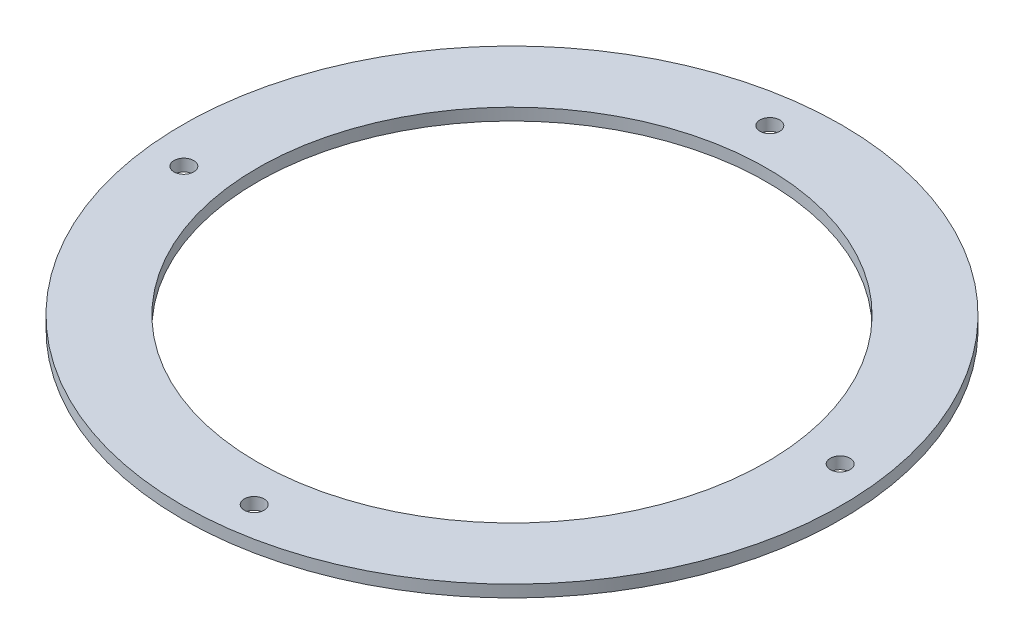
ISO-10303-21;
HEADER;
FILE_DESCRIPTION(('STEP AP214'),'2;1');
FILE_NAME('part.step','',(''),(''),'','','');
FILE_SCHEMA(('AUTOMOTIVE_DESIGN { 1 0 10303 214 1 1 1 1 }'));
ENDSEC;
DATA;
#1=APPLICATION_CONTEXT('core data for automotive mechanical design processes');
#2=APPLICATION_PROTOCOL_DEFINITION('international standard','automotive_design',2000,#1);
#3=PRODUCT_CONTEXT('',#1,'mechanical');
#4=PRODUCT('Part','Part','',(#3));
#5=PRODUCT_RELATED_PRODUCT_CATEGORY('part','',(#4));
#6=PRODUCT_DEFINITION_FORMATION('','',#4);
#7=PRODUCT_DEFINITION_CONTEXT('part definition',#1,'design');
#8=PRODUCT_DEFINITION('design','',#6,#7);
#9=PRODUCT_DEFINITION_SHAPE('','',#8);
#10=(LENGTH_UNIT() NAMED_UNIT(*) SI_UNIT(.MILLI.,.METRE.));
#11=(NAMED_UNIT(*) PLANE_ANGLE_UNIT() SI_UNIT($,.RADIAN.));
#12=(NAMED_UNIT(*) SI_UNIT($,.STERADIAN.) SOLID_ANGLE_UNIT());
#13=UNCERTAINTY_MEASURE_WITH_UNIT(LENGTH_MEASURE(1.E-05),#10,'distance_accuracy_value','');
#14=(GEOMETRIC_REPRESENTATION_CONTEXT(3) GLOBAL_UNCERTAINTY_ASSIGNED_CONTEXT((#13)) GLOBAL_UNIT_ASSIGNED_CONTEXT((#10,
#11,#12)) REPRESENTATION_CONTEXT('',''));
#15=CARTESIAN_POINT('',(0.,0.,0.));
#16=DIRECTION('',(0.,0.,1.));
#17=DIRECTION('',(1.,0.,0.));
#18=AXIS2_PLACEMENT_3D('',#15,#16,#17);
#19=CARTESIAN_POINT('',(0.,2.,0.));
#20=DIRECTION('',(0.,-1.,0.));
#21=DIRECTION('',(0.,0.,-1.));
#22=AXIS2_PLACEMENT_3D('',#19,#20,#21);
#23=CYLINDRICAL_SURFACE('',#22,55.);
#24=CARTESIAN_POINT('',(0.,2.,0.));
#25=DIRECTION('',(0.,1.,0.));
#26=DIRECTION('',(0.,0.,1.));
#27=AXIS2_PLACEMENT_3D('',#24,#25,#26);
#28=CIRCLE('',#27,55.);
#29=CARTESIAN_POINT('',(0.,2.,55.));
#30=VERTEX_POINT('',#29);
#31=EDGE_CURVE('E10',#30,#30,#28,.T.);
#32=ORIENTED_EDGE('',*,*,#31,.F.);
#33=EDGE_LOOP('',(#32));
#34=FACE_BOUND('',#33,.T.);
#35=CARTESIAN_POINT('',(0.,0.,0.));
#36=DIRECTION('',(0.,1.,0.));
#37=DIRECTION('',(0.,0.,1.));
#38=AXIS2_PLACEMENT_3D('',#35,#36,#37);
#39=CIRCLE('',#38,55.);
#40=CARTESIAN_POINT('',(0.,0.,55.));
#41=VERTEX_POINT('',#40);
#42=EDGE_CURVE('E37',#41,#41,#39,.T.);
#43=ORIENTED_EDGE('',*,*,#42,.T.);
#44=EDGE_LOOP('',(#43));
#45=FACE_BOUND('',#44,.T.);
#46=ADVANCED_FACE('F30',(#34,#45),#23,.T.);
#47=CARTESIAN_POINT('',(0.,2.,0.));
#48=DIRECTION('',(0.,1.,0.));
#49=DIRECTION('',(0.,0.,1.));
#50=AXIS2_PLACEMENT_3D('',#47,#48,#49);
#51=PLANE('',#50);
#52=CARTESIAN_POINT('',(0.,2.,0.));
#53=DIRECTION('',(0.,1.,0.));
#54=DIRECTION('',(0.,0.,1.));
#55=AXIS2_PLACEMENT_3D('',#52,#53,#54);
#56=CIRCLE('',#55,42.5);
#57=CARTESIAN_POINT('',(0.,2.,42.5));
#58=VERTEX_POINT('',#57);
#59=EDGE_CURVE('E120',#58,#58,#56,.T.);
#60=ORIENTED_EDGE('',*,*,#59,.F.);
#61=EDGE_LOOP('',(#60));
#62=FACE_BOUND('',#61,.T.);
#63=CARTESIAN_POINT('',(-48.8989858314834,2.,5.86955574574058));
#64=DIRECTION('',(0.,1.,0.));
#65=DIRECTION('',(0.,0.,1.));
#66=AXIS2_PLACEMENT_3D('',#63,#64,#65);
#67=CIRCLE('',#66,1.65);
#68=CARTESIAN_POINT('',(-48.8989858314834,2.,7.51955574574058));
#69=VERTEX_POINT('',#68);
#70=EDGE_CURVE('E52',#69,#69,#67,.T.);
#71=ORIENTED_EDGE('',*,*,#70,.F.);
#72=EDGE_LOOP('',(#71));
#73=FACE_BOUND('',#72,.T.);
#74=CARTESIAN_POINT('',(-5.86955574574058,2.,-48.8989858314834));
#75=DIRECTION('',(0.,1.,0.));
#76=DIRECTION('',(0.,0.,1.));
#77=AXIS2_PLACEMENT_3D('',#74,#75,#76);
#78=CIRCLE('',#77,1.65);
#79=CARTESIAN_POINT('',(-5.86955574574058,2.,-47.2489858314834));
#80=VERTEX_POINT('',#79);
#81=EDGE_CURVE('E114',#80,#80,#78,.T.);
#82=ORIENTED_EDGE('',*,*,#81,.F.);
#83=EDGE_LOOP('',(#82));
#84=FACE_BOUND('',#83,.T.);
#85=CARTESIAN_POINT('',(48.8989858314834,2.,-5.86955574574058));
#86=DIRECTION('',(0.,1.,0.));
#87=DIRECTION('',(0.,0.,1.));
#88=AXIS2_PLACEMENT_3D('',#85,#86,#87);
#89=CIRCLE('',#88,1.65);
#90=CARTESIAN_POINT('',(48.8989858314834,2.,-4.21955574574058));
#91=VERTEX_POINT('',#90);
#92=EDGE_CURVE('E107',#91,#91,#89,.T.);
#93=ORIENTED_EDGE('',*,*,#92,.F.);
#94=EDGE_LOOP('',(#93));
#95=FACE_BOUND('',#94,.T.);
#96=CARTESIAN_POINT('',(5.86955574574059,2.,48.8989858314834));
#97=DIRECTION('',(0.,1.,0.));
#98=DIRECTION('',(0.,0.,1.));
#99=AXIS2_PLACEMENT_3D('',#96,#97,#98);
#100=CIRCLE('',#99,1.65);
#101=CARTESIAN_POINT('',(5.86955574574059,2.,50.5489858314834));
#102=VERTEX_POINT('',#101);
#103=EDGE_CURVE('E45',#102,#102,#100,.T.);
#104=ORIENTED_EDGE('',*,*,#103,.F.);
#105=EDGE_LOOP('',(#104));
#106=FACE_BOUND('',#105,.T.);
#107=ORIENTED_EDGE('',*,*,#31,.T.);
#108=EDGE_LOOP('',(#107));
#109=FACE_BOUND('',#108,.T.);
#110=ADVANCED_FACE('F80',(#62,#73,#84,#95,#106,#109),#51,.T.);
#111=CARTESIAN_POINT('',(0.,0.,0.));
#112=DIRECTION('',(0.,1.,0.));
#113=DIRECTION('',(0.,0.,1.));
#114=AXIS2_PLACEMENT_3D('',#111,#112,#113);
#115=PLANE('',#114);
#116=CARTESIAN_POINT('',(0.,0.,0.));
#117=DIRECTION('',(0.,1.,0.));
#118=DIRECTION('',(0.,0.,1.));
#119=AXIS2_PLACEMENT_3D('',#116,#117,#118);
#120=CIRCLE('',#119,42.5);
#121=CARTESIAN_POINT('',(0.,0.,42.5));
#122=VERTEX_POINT('',#121);
#123=EDGE_CURVE('E33',#122,#122,#120,.T.);
#124=ORIENTED_EDGE('',*,*,#123,.T.);
#125=EDGE_LOOP('',(#124));
#126=FACE_BOUND('',#125,.T.);
#127=CARTESIAN_POINT('',(-48.8989858314834,0.,5.86955574574058));
#128=DIRECTION('',(0.,1.,0.));
#129=DIRECTION('',(0.,0.,1.));
#130=AXIS2_PLACEMENT_3D('',#127,#128,#129);
#131=CIRCLE('',#130,1.65);
#132=CARTESIAN_POINT('',(-48.8989858314834,0.,7.51955574574058));
#133=VERTEX_POINT('',#132);
#134=EDGE_CURVE('E42',#133,#133,#131,.T.);
#135=ORIENTED_EDGE('',*,*,#134,.T.);
#136=EDGE_LOOP('',(#135));
#137=FACE_BOUND('',#136,.T.);
#138=CARTESIAN_POINT('',(-5.86955574574058,0.,-48.8989858314834));
#139=DIRECTION('',(0.,1.,0.));
#140=DIRECTION('',(0.,0.,1.));
#141=AXIS2_PLACEMENT_3D('',#138,#139,#140);
#142=CIRCLE('',#141,1.65);
#143=CARTESIAN_POINT('',(-5.86955574574058,0.,-47.2489858314834));
#144=VERTEX_POINT('',#143);
#145=EDGE_CURVE('E55',#144,#144,#142,.T.);
#146=ORIENTED_EDGE('',*,*,#145,.T.);
#147=EDGE_LOOP('',(#146));
#148=FACE_BOUND('',#147,.T.);
#149=CARTESIAN_POINT('',(48.8989858314834,0.,-5.86955574574058));
#150=DIRECTION('',(0.,1.,0.));
#151=DIRECTION('',(0.,0.,1.));
#152=AXIS2_PLACEMENT_3D('',#149,#150,#151);
#153=CIRCLE('',#152,1.65);
#154=CARTESIAN_POINT('',(48.8989858314834,0.,-4.21955574574058));
#155=VERTEX_POINT('',#154);
#156=EDGE_CURVE('E51',#155,#155,#153,.T.);
#157=ORIENTED_EDGE('',*,*,#156,.T.);
#158=EDGE_LOOP('',(#157));
#159=FACE_BOUND('',#158,.T.);
#160=CARTESIAN_POINT('',(5.86955574574059,0.,48.8989858314834));
#161=DIRECTION('',(0.,1.,0.));
#162=DIRECTION('',(0.,0.,1.));
#163=AXIS2_PLACEMENT_3D('',#160,#161,#162);
#164=CIRCLE('',#163,1.65);
#165=CARTESIAN_POINT('',(5.86955574574059,0.,50.5489858314834));
#166=VERTEX_POINT('',#165);
#167=EDGE_CURVE('E48',#166,#166,#164,.T.);
#168=ORIENTED_EDGE('',*,*,#167,.T.);
#169=EDGE_LOOP('',(#168));
#170=FACE_BOUND('',#169,.T.);
#171=ORIENTED_EDGE('',*,*,#42,.F.);
#172=EDGE_LOOP('',(#171));
#173=FACE_BOUND('',#172,.T.);
#174=ADVANCED_FACE('F60',(#126,#137,#148,#159,#170,#173),#115,.F.);
#175=CARTESIAN_POINT('',(5.86955574574059,-12.,48.8989858314834));
#176=DIRECTION('',(0.,1.,0.));
#177=DIRECTION('',(0.,0.,1.));
#178=AXIS2_PLACEMENT_3D('',#175,#176,#177);
#179=CYLINDRICAL_SURFACE('',#178,1.65);
#180=ORIENTED_EDGE('',*,*,#103,.T.);
#181=EDGE_LOOP('',(#180));
#182=FACE_BOUND('',#181,.T.);
#183=ORIENTED_EDGE('',*,*,#167,.F.);
#184=EDGE_LOOP('',(#183));
#185=FACE_BOUND('',#184,.T.);
#186=ADVANCED_FACE('F91',(#182,#185),#179,.F.);
#187=CARTESIAN_POINT('',(48.8989858314834,-12.,-5.86955574574058));
#188=DIRECTION('',(0.,1.,0.));
#189=DIRECTION('',(0.,0.,1.));
#190=AXIS2_PLACEMENT_3D('',#187,#188,#189);
#191=CYLINDRICAL_SURFACE('',#190,1.65);
#192=ORIENTED_EDGE('',*,*,#92,.T.);
#193=EDGE_LOOP('',(#192));
#194=FACE_BOUND('',#193,.T.);
#195=ORIENTED_EDGE('',*,*,#156,.F.);
#196=EDGE_LOOP('',(#195));
#197=FACE_BOUND('',#196,.T.);
#198=ADVANCED_FACE('F75',(#194,#197),#191,.F.);
#199=CARTESIAN_POINT('',(-5.86955574574058,-12.,-48.8989858314834));
#200=DIRECTION('',(0.,1.,0.));
#201=DIRECTION('',(0.,0.,1.));
#202=AXIS2_PLACEMENT_3D('',#199,#200,#201);
#203=CYLINDRICAL_SURFACE('',#202,1.65);
#204=ORIENTED_EDGE('',*,*,#81,.T.);
#205=EDGE_LOOP('',(#204));
#206=FACE_BOUND('',#205,.T.);
#207=ORIENTED_EDGE('',*,*,#145,.F.);
#208=EDGE_LOOP('',(#207));
#209=FACE_BOUND('',#208,.T.);
#210=ADVANCED_FACE('F66',(#206,#209),#203,.F.);
#211=CARTESIAN_POINT('',(-48.8989858314834,-12.,5.86955574574058));
#212=DIRECTION('',(0.,1.,0.));
#213=DIRECTION('',(0.,0.,1.));
#214=AXIS2_PLACEMENT_3D('',#211,#212,#213);
#215=CYLINDRICAL_SURFACE('',#214,1.65);
#216=ORIENTED_EDGE('',*,*,#70,.T.);
#217=EDGE_LOOP('',(#216));
#218=FACE_BOUND('',#217,.T.);
#219=ORIENTED_EDGE('',*,*,#134,.F.);
#220=EDGE_LOOP('',(#219));
#221=FACE_BOUND('',#220,.T.);
#222=ADVANCED_FACE('F63',(#218,#221),#215,.F.);
#223=CARTESIAN_POINT('',(0.,-12.,0.));
#224=DIRECTION('',(0.,1.,0.));
#225=DIRECTION('',(0.,0.,1.));
#226=AXIS2_PLACEMENT_3D('',#223,#224,#225);
#227=CYLINDRICAL_SURFACE('',#226,42.5);
#228=ORIENTED_EDGE('',*,*,#59,.T.);
#229=EDGE_LOOP('',(#228));
#230=FACE_BOUND('',#229,.T.);
#231=ORIENTED_EDGE('',*,*,#123,.F.);
#232=EDGE_LOOP('',(#231));
#233=FACE_BOUND('',#232,.T.);
#234=ADVANCED_FACE('F65',(#230,#233),#227,.F.);
#235=CLOSED_SHELL('',(#46,#110,#174,#186,#198,#210,#222,#234));
#236=MANIFOLD_SOLID_BREP('B2',#235);
#237=ADVANCED_BREP_SHAPE_REPRESENTATION('',(#18,#236),#14);
#238=SHAPE_DEFINITION_REPRESENTATION(#9,#237);
ENDSEC;
END-ISO-10303-21;
